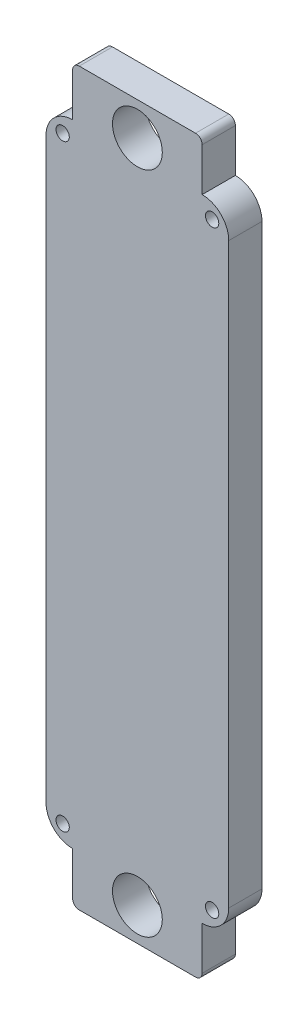
ISO-10303-21;
HEADER;
FILE_DESCRIPTION(('STEP AP214'),'2;1');
FILE_NAME('part.step','',(''),(''),'','','');
FILE_SCHEMA(('AUTOMOTIVE_DESIGN { 1 0 10303 214 1 1 1 1 }'));
ENDSEC;
DATA;
#1=APPLICATION_CONTEXT('core data for automotive mechanical design processes');
#2=APPLICATION_PROTOCOL_DEFINITION('international standard','automotive_design',2000,#1);
#3=PRODUCT_CONTEXT('',#1,'mechanical');
#4=PRODUCT('Part','Part','',(#3));
#5=PRODUCT_RELATED_PRODUCT_CATEGORY('part','',(#4));
#6=PRODUCT_DEFINITION_FORMATION('','',#4);
#7=PRODUCT_DEFINITION_CONTEXT('part definition',#1,'design');
#8=PRODUCT_DEFINITION('design','',#6,#7);
#9=PRODUCT_DEFINITION_SHAPE('','',#8);
#10=(LENGTH_UNIT() NAMED_UNIT(*) SI_UNIT(.MILLI.,.METRE.));
#11=(NAMED_UNIT(*) PLANE_ANGLE_UNIT() SI_UNIT($,.RADIAN.));
#12=(NAMED_UNIT(*) SI_UNIT($,.STERADIAN.) SOLID_ANGLE_UNIT());
#13=UNCERTAINTY_MEASURE_WITH_UNIT(LENGTH_MEASURE(1.E-05),#10,'distance_accuracy_value','');
#14=(GEOMETRIC_REPRESENTATION_CONTEXT(3) GLOBAL_UNCERTAINTY_ASSIGNED_CONTEXT((#13)) GLOBAL_UNIT_ASSIGNED_CONTEXT((#10,
#11,#12)) REPRESENTATION_CONTEXT('',''));
#15=CARTESIAN_POINT('',(0.,0.,0.));
#16=DIRECTION('',(0.,0.,1.));
#17=DIRECTION('',(1.,0.,0.));
#18=AXIS2_PLACEMENT_3D('',#15,#16,#17);
#19=CARTESIAN_POINT('',(0.,0.,10.));
#20=DIRECTION('',(0.,0.,1.));
#21=DIRECTION('',(1.,0.,0.));
#22=AXIS2_PLACEMENT_3D('',#19,#20,#21);
#23=PLANE('',#22);
#24=CARTESIAN_POINT('',(0.,100.,10.));
#25=DIRECTION('',(0.,0.,1.));
#26=DIRECTION('',(1.,0.,0.));
#27=AXIS2_PLACEMENT_3D('',#24,#25,#26);
#28=CIRCLE('',#27,7.5);
#29=CARTESIAN_POINT('',(7.5,100.,10.));
#30=VERTEX_POINT('',#29);
#31=EDGE_CURVE('E315',#30,#30,#28,.T.);
#32=ORIENTED_EDGE('',*,*,#31,.F.);
#33=EDGE_LOOP('',(#32));
#34=FACE_BOUND('',#33,.T.);
#35=CARTESIAN_POINT('',(0.,-100.,10.));
#36=DIRECTION('',(0.,0.,1.));
#37=DIRECTION('',(1.,0.,0.));
#38=AXIS2_PLACEMENT_3D('',#35,#36,#37);
#39=CIRCLE('',#38,7.5);
#40=CARTESIAN_POINT('',(7.5,-100.,10.));
#41=VERTEX_POINT('',#40);
#42=EDGE_CURVE('E391',#41,#41,#39,.T.);
#43=ORIENTED_EDGE('',*,*,#42,.F.);
#44=EDGE_LOOP('',(#43));
#45=FACE_BOUND('',#44,.T.);
#46=CARTESIAN_POINT('',(-22.5,-90.,10.));
#47=DIRECTION('',(0.,0.,1.));
#48=DIRECTION('',(1.,0.,0.));
#49=AXIS2_PLACEMENT_3D('',#46,#47,#48);
#50=CIRCLE('',#49,2.00000000000001);
#51=CARTESIAN_POINT('',(-20.5,-90.,10.));
#52=VERTEX_POINT('',#51);
#53=EDGE_CURVE('E348',#52,#52,#50,.T.);
#54=ORIENTED_EDGE('',*,*,#53,.F.);
#55=EDGE_LOOP('',(#54));
#56=FACE_BOUND('',#55,.T.);
#57=CARTESIAN_POINT('',(-22.5,90.,10.));
#58=DIRECTION('',(0.,0.,1.));
#59=DIRECTION('',(1.,0.,0.));
#60=AXIS2_PLACEMENT_3D('',#57,#58,#59);
#61=CIRCLE('',#60,2.00000000000001);
#62=CARTESIAN_POINT('',(-20.5,90.,10.));
#63=VERTEX_POINT('',#62);
#64=EDGE_CURVE('E364',#63,#63,#61,.T.);
#65=ORIENTED_EDGE('',*,*,#64,.F.);
#66=EDGE_LOOP('',(#65));
#67=FACE_BOUND('',#66,.T.);
#68=DIRECTION('',(-1.,0.,0.));
#69=VECTOR('',#68,1.);
#70=CARTESIAN_POINT('',(-19.5,110.,10.));
#71=LINE('',#70,#69);
#72=CARTESIAN_POINT('',(17.5,110.,10.));
#73=VERTEX_POINT('',#72);
#74=CARTESIAN_POINT('',(-17.5,110.,10.));
#75=VERTEX_POINT('',#74);
#76=EDGE_CURVE('E323',#73,#75,#71,.T.);
#77=ORIENTED_EDGE('',*,*,#76,.T.);
#78=CARTESIAN_POINT('',(-17.5,108.,10.));
#79=DIRECTION('',(0.,0.,1.));
#80=DIRECTION('',(1.,0.,0.));
#81=AXIS2_PLACEMENT_3D('',#78,#79,#80);
#82=CIRCLE('',#81,2.);
#83=CARTESIAN_POINT('',(-19.5,108.,10.));
#84=VERTEX_POINT('',#83);
#85=EDGE_CURVE('E257',#75,#84,#82,.T.);
#86=ORIENTED_EDGE('',*,*,#85,.T.);
#87=DIRECTION('',(0.,-1.,0.));
#88=VECTOR('',#87,1.);
#89=CARTESIAN_POINT('',(-19.5,95.,10.));
#90=LINE('',#89,#88);
#91=CARTESIAN_POINT('',(-19.5,95.,10.));
#92=VERTEX_POINT('',#91);
#93=EDGE_CURVE('E331',#84,#92,#90,.T.);
#94=ORIENTED_EDGE('',*,*,#93,.T.);
#95=CARTESIAN_POINT('',(-19.5,87.,10.));
#96=DIRECTION('',(0.,0.,1.));
#97=DIRECTION('',(1.,0.,0.));
#98=AXIS2_PLACEMENT_3D('',#95,#96,#97);
#99=CIRCLE('',#98,8.);
#100=CARTESIAN_POINT('',(-27.5,87.,10.));
#101=VERTEX_POINT('',#100);
#102=EDGE_CURVE('E222',#92,#101,#99,.T.);
#103=ORIENTED_EDGE('',*,*,#102,.T.);
#104=DIRECTION('',(0.,-1.,0.));
#105=VECTOR('',#104,1.);
#106=CARTESIAN_POINT('',(-27.5,95.,10.));
#107=LINE('',#106,#105);
#108=CARTESIAN_POINT('',(-27.5,-87.,10.));
#109=VERTEX_POINT('',#108);
#110=EDGE_CURVE('E189',#101,#109,#107,.T.);
#111=ORIENTED_EDGE('',*,*,#110,.T.);
#112=CARTESIAN_POINT('',(-19.5,-87.,10.));
#113=DIRECTION('',(0.,0.,1.));
#114=DIRECTION('',(1.,0.,0.));
#115=AXIS2_PLACEMENT_3D('',#112,#113,#114);
#116=CIRCLE('',#115,8.);
#117=CARTESIAN_POINT('',(-19.5,-95.,10.));
#118=VERTEX_POINT('',#117);
#119=EDGE_CURVE('E180',#109,#118,#116,.T.);
#120=ORIENTED_EDGE('',*,*,#119,.T.);
#121=DIRECTION('',(0.,-1.,0.));
#122=VECTOR('',#121,1.);
#123=CARTESIAN_POINT('',(-19.5,-95.,10.));
#124=LINE('',#123,#122);
#125=CARTESIAN_POINT('',(-19.5,-108.,10.));
#126=VERTEX_POINT('',#125);
#127=EDGE_CURVE('E305',#118,#126,#124,.T.);
#128=ORIENTED_EDGE('',*,*,#127,.T.);
#129=CARTESIAN_POINT('',(-17.5,-108.,10.));
#130=DIRECTION('',(0.,0.,1.));
#131=DIRECTION('',(1.,0.,0.));
#132=AXIS2_PLACEMENT_3D('',#129,#130,#131);
#133=CIRCLE('',#132,2.);
#134=CARTESIAN_POINT('',(-17.5,-110.,10.));
#135=VERTEX_POINT('',#134);
#136=EDGE_CURVE('E251',#126,#135,#133,.T.);
#137=ORIENTED_EDGE('',*,*,#136,.T.);
#138=DIRECTION('',(1.,0.,0.));
#139=VECTOR('',#138,1.);
#140=CARTESIAN_POINT('',(-19.5,-110.,10.));
#141=LINE('',#140,#139);
#142=CARTESIAN_POINT('',(17.5,-110.,10.));
#143=VERTEX_POINT('',#142);
#144=EDGE_CURVE('E170',#135,#143,#141,.T.);
#145=ORIENTED_EDGE('',*,*,#144,.T.);
#146=CARTESIAN_POINT('',(17.5,-108.,10.));
#147=DIRECTION('',(0.,0.,1.));
#148=DIRECTION('',(1.,0.,0.));
#149=AXIS2_PLACEMENT_3D('',#146,#147,#148);
#150=CIRCLE('',#149,2.);
#151=CARTESIAN_POINT('',(19.5,-108.,10.));
#152=VERTEX_POINT('',#151);
#153=EDGE_CURVE('E164',#143,#152,#150,.T.);
#154=ORIENTED_EDGE('',*,*,#153,.T.);
#155=DIRECTION('',(0.,1.,0.));
#156=VECTOR('',#155,1.);
#157=CARTESIAN_POINT('',(19.5,-95.,10.));
#158=LINE('',#157,#156);
#159=CARTESIAN_POINT('',(19.5,-95.,10.));
#160=VERTEX_POINT('',#159);
#161=EDGE_CURVE('E156',#152,#160,#158,.T.);
#162=ORIENTED_EDGE('',*,*,#161,.T.);
#163=CARTESIAN_POINT('',(19.5,-87.,10.));
#164=DIRECTION('',(0.,0.,1.));
#165=DIRECTION('',(1.,0.,0.));
#166=AXIS2_PLACEMENT_3D('',#163,#164,#165);
#167=CIRCLE('',#166,8.);
#168=CARTESIAN_POINT('',(27.5,-87.,10.));
#169=VERTEX_POINT('',#168);
#170=EDGE_CURVE('E161',#160,#169,#167,.T.);
#171=ORIENTED_EDGE('',*,*,#170,.T.);
#172=DIRECTION('',(0.,1.,0.));
#173=VECTOR('',#172,1.);
#174=CARTESIAN_POINT('',(27.5,95.,10.));
#175=LINE('',#174,#173);
#176=CARTESIAN_POINT('',(27.5,87.,10.));
#177=VERTEX_POINT('',#176);
#178=EDGE_CURVE('E197',#169,#177,#175,.T.);
#179=ORIENTED_EDGE('',*,*,#178,.T.);
#180=CARTESIAN_POINT('',(19.5,87.,10.));
#181=DIRECTION('',(0.,0.,1.));
#182=DIRECTION('',(1.,0.,0.));
#183=AXIS2_PLACEMENT_3D('',#180,#181,#182);
#184=CIRCLE('',#183,8.);
#185=CARTESIAN_POINT('',(19.5,95.,10.));
#186=VERTEX_POINT('',#185);
#187=EDGE_CURVE('E181',#177,#186,#184,.T.);
#188=ORIENTED_EDGE('',*,*,#187,.T.);
#189=DIRECTION('',(0.,1.,0.));
#190=VECTOR('',#189,1.);
#191=CARTESIAN_POINT('',(19.5,95.,10.));
#192=LINE('',#191,#190);
#193=CARTESIAN_POINT('',(19.5,108.,10.));
#194=VERTEX_POINT('',#193);
#195=EDGE_CURVE('E334',#186,#194,#192,.T.);
#196=ORIENTED_EDGE('',*,*,#195,.T.);
#197=CARTESIAN_POINT('',(17.5,108.,10.));
#198=DIRECTION('',(0.,0.,1.));
#199=DIRECTION('',(1.,0.,0.));
#200=AXIS2_PLACEMENT_3D('',#197,#198,#199);
#201=CIRCLE('',#200,2.);
#202=EDGE_CURVE('E254',#194,#73,#201,.T.);
#203=ORIENTED_EDGE('',*,*,#202,.T.);
#204=EDGE_LOOP('',(#77,#86,#94,#103,#111,#120,#128,#137,#145,#154,#162,#171,#179,#188,#196,#203));
#205=FACE_BOUND('',#204,.T.);
#206=CARTESIAN_POINT('',(22.5,90.,10.));
#207=DIRECTION('',(0.,0.,1.));
#208=DIRECTION('',(1.,0.,0.));
#209=AXIS2_PLACEMENT_3D('',#206,#207,#208);
#210=CIRCLE('',#209,2.00000000000001);
#211=CARTESIAN_POINT('',(24.5,90.,10.));
#212=VERTEX_POINT('',#211);
#213=EDGE_CURVE('E356',#212,#212,#210,.T.);
#214=ORIENTED_EDGE('',*,*,#213,.F.);
#215=EDGE_LOOP('',(#214));
#216=FACE_BOUND('',#215,.T.);
#217=CARTESIAN_POINT('',(22.5,-90.,10.));
#218=DIRECTION('',(0.,0.,1.));
#219=DIRECTION('',(1.,0.,0.));
#220=AXIS2_PLACEMENT_3D('',#217,#218,#219);
#221=CIRCLE('',#220,2.);
#222=CARTESIAN_POINT('',(24.5,-90.,10.));
#223=VERTEX_POINT('',#222);
#224=EDGE_CURVE('E340',#223,#223,#221,.T.);
#225=ORIENTED_EDGE('',*,*,#224,.F.);
#226=EDGE_LOOP('',(#225));
#227=FACE_BOUND('',#226,.T.);
#228=ADVANCED_FACE('F41',(#34,#45,#56,#67,#205,#216,#227),#23,.T.);
#229=CARTESIAN_POINT('',(0.,0.,0.));
#230=DIRECTION('',(0.,0.,1.));
#231=DIRECTION('',(1.,0.,0.));
#232=AXIS2_PLACEMENT_3D('',#229,#230,#231);
#233=PLANE('',#232);
#234=CARTESIAN_POINT('',(0.,100.,0.));
#235=DIRECTION('',(0.,0.,1.));
#236=DIRECTION('',(1.,0.,0.));
#237=AXIS2_PLACEMENT_3D('',#234,#235,#236);
#238=CIRCLE('',#237,7.5);
#239=CARTESIAN_POINT('',(7.5,100.,0.));
#240=VERTEX_POINT('',#239);
#241=EDGE_CURVE('E309',#240,#240,#238,.T.);
#242=ORIENTED_EDGE('',*,*,#241,.T.);
#243=EDGE_LOOP('',(#242));
#244=FACE_BOUND('',#243,.T.);
#245=CARTESIAN_POINT('',(0.,-100.,0.));
#246=DIRECTION('',(0.,0.,1.));
#247=DIRECTION('',(1.,0.,0.));
#248=AXIS2_PLACEMENT_3D('',#245,#246,#247);
#249=CIRCLE('',#248,7.5);
#250=CARTESIAN_POINT('',(7.5,-100.,0.));
#251=VERTEX_POINT('',#250);
#252=EDGE_CURVE('E395',#251,#251,#249,.T.);
#253=ORIENTED_EDGE('',*,*,#252,.T.);
#254=EDGE_LOOP('',(#253));
#255=FACE_BOUND('',#254,.T.);
#256=DIRECTION('',(0.,-1.,0.));
#257=VECTOR('',#256,1.);
#258=CARTESIAN_POINT('',(-19.5,95.,0.));
#259=LINE('',#258,#257);
#260=CARTESIAN_POINT('',(-19.5,108.,0.));
#261=VERTEX_POINT('',#260);
#262=CARTESIAN_POINT('',(-19.5,95.,0.));
#263=VERTEX_POINT('',#262);
#264=EDGE_CURVE('E319',#261,#263,#259,.T.);
#265=ORIENTED_EDGE('',*,*,#264,.F.);
#266=CARTESIAN_POINT('',(-17.5,108.,0.));
#267=DIRECTION('',(0.,0.,1.));
#268=DIRECTION('',(1.,0.,0.));
#269=AXIS2_PLACEMENT_3D('',#266,#267,#268);
#270=CIRCLE('',#269,2.);
#271=CARTESIAN_POINT('',(-17.5,110.,0.));
#272=VERTEX_POINT('',#271);
#273=EDGE_CURVE('E270',#261,#272,#270,.F.);
#274=ORIENTED_EDGE('',*,*,#273,.T.);
#275=DIRECTION('',(-1.,0.,0.));
#276=VECTOR('',#275,1.);
#277=CARTESIAN_POINT('',(-19.5,110.,0.));
#278=LINE('',#277,#276);
#279=CARTESIAN_POINT('',(17.5,110.,0.));
#280=VERTEX_POINT('',#279);
#281=EDGE_CURVE('E326',#280,#272,#278,.T.);
#282=ORIENTED_EDGE('',*,*,#281,.F.);
#283=CARTESIAN_POINT('',(17.5,108.,0.));
#284=DIRECTION('',(0.,0.,1.));
#285=DIRECTION('',(1.,0.,0.));
#286=AXIS2_PLACEMENT_3D('',#283,#284,#285);
#287=CIRCLE('',#286,2.);
#288=CARTESIAN_POINT('',(19.5,108.,0.));
#289=VERTEX_POINT('',#288);
#290=EDGE_CURVE('E57',#280,#289,#287,.F.);
#291=ORIENTED_EDGE('',*,*,#290,.T.);
#292=DIRECTION('',(0.,1.,0.));
#293=VECTOR('',#292,1.);
#294=CARTESIAN_POINT('',(19.5,95.,0.));
#295=LINE('',#294,#293);
#296=CARTESIAN_POINT('',(19.5,95.,0.));
#297=VERTEX_POINT('',#296);
#298=EDGE_CURVE('E322',#297,#289,#295,.T.);
#299=ORIENTED_EDGE('',*,*,#298,.F.);
#300=CARTESIAN_POINT('',(19.5,87.,0.));
#301=DIRECTION('',(0.,0.,1.));
#302=DIRECTION('',(1.,0.,0.));
#303=AXIS2_PLACEMENT_3D('',#300,#301,#302);
#304=CIRCLE('',#303,8.);
#305=CARTESIAN_POINT('',(27.5,87.,0.));
#306=VERTEX_POINT('',#305);
#307=EDGE_CURVE('E206',#297,#306,#304,.F.);
#308=ORIENTED_EDGE('',*,*,#307,.T.);
#309=DIRECTION('',(0.,1.,0.));
#310=VECTOR('',#309,1.);
#311=CARTESIAN_POINT('',(27.5,95.,0.));
#312=LINE('',#311,#310);
#313=CARTESIAN_POINT('',(27.5,-87.,0.));
#314=VERTEX_POINT('',#313);
#315=EDGE_CURVE('E368',#314,#306,#312,.T.);
#316=ORIENTED_EDGE('',*,*,#315,.F.);
#317=CARTESIAN_POINT('',(19.5,-87.,0.));
#318=DIRECTION('',(0.,0.,1.));
#319=DIRECTION('',(1.,0.,0.));
#320=AXIS2_PLACEMENT_3D('',#317,#318,#319);
#321=CIRCLE('',#320,8.);
#322=CARTESIAN_POINT('',(19.5,-95.,0.));
#323=VERTEX_POINT('',#322);
#324=EDGE_CURVE('E209',#314,#323,#321,.F.);
#325=ORIENTED_EDGE('',*,*,#324,.T.);
#326=DIRECTION('',(0.,1.,0.));
#327=VECTOR('',#326,1.);
#328=CARTESIAN_POINT('',(19.5,-95.,0.));
#329=LINE('',#328,#327);
#330=CARTESIAN_POINT('',(19.5,-108.,0.));
#331=VERTEX_POINT('',#330);
#332=EDGE_CURVE('E185',#331,#323,#329,.T.);
#333=ORIENTED_EDGE('',*,*,#332,.F.);
#334=CARTESIAN_POINT('',(17.5,-108.,0.));
#335=DIRECTION('',(0.,0.,1.));
#336=DIRECTION('',(1.,0.,0.));
#337=AXIS2_PLACEMENT_3D('',#334,#335,#336);
#338=CIRCLE('',#337,2.);
#339=CARTESIAN_POINT('',(17.5,-110.,0.));
#340=VERTEX_POINT('',#339);
#341=EDGE_CURVE('E263',#331,#340,#338,.F.);
#342=ORIENTED_EDGE('',*,*,#341,.T.);
#343=DIRECTION('',(1.,0.,0.));
#344=VECTOR('',#343,1.);
#345=CARTESIAN_POINT('',(-19.5,-110.,0.));
#346=LINE('',#345,#344);
#347=CARTESIAN_POINT('',(-17.5,-110.,0.));
#348=VERTEX_POINT('',#347);
#349=EDGE_CURVE('E290',#348,#340,#346,.T.);
#350=ORIENTED_EDGE('',*,*,#349,.F.);
#351=CARTESIAN_POINT('',(-17.5,-108.,0.));
#352=DIRECTION('',(0.,0.,1.));
#353=DIRECTION('',(1.,0.,0.));
#354=AXIS2_PLACEMENT_3D('',#351,#352,#353);
#355=CIRCLE('',#354,2.);
#356=CARTESIAN_POINT('',(-19.5,-108.,0.));
#357=VERTEX_POINT('',#356);
#358=EDGE_CURVE('E64',#348,#357,#355,.F.);
#359=ORIENTED_EDGE('',*,*,#358,.T.);
#360=DIRECTION('',(0.,-1.,0.));
#361=VECTOR('',#360,1.);
#362=CARTESIAN_POINT('',(-19.5,-95.,0.));
#363=LINE('',#362,#361);
#364=CARTESIAN_POINT('',(-19.5,-95.,0.));
#365=VERTEX_POINT('',#364);
#366=EDGE_CURVE('E169',#365,#357,#363,.T.);
#367=ORIENTED_EDGE('',*,*,#366,.F.);
#368=CARTESIAN_POINT('',(-19.5,-87.,0.));
#369=DIRECTION('',(0.,0.,1.));
#370=DIRECTION('',(1.,0.,0.));
#371=AXIS2_PLACEMENT_3D('',#368,#369,#370);
#372=CIRCLE('',#371,8.);
#373=CARTESIAN_POINT('',(-27.5,-87.,0.));
#374=VERTEX_POINT('',#373);
#375=EDGE_CURVE('E212',#365,#374,#372,.F.);
#376=ORIENTED_EDGE('',*,*,#375,.T.);
#377=DIRECTION('',(0.,-1.,0.));
#378=VECTOR('',#377,1.);
#379=CARTESIAN_POINT('',(-27.5,95.,0.));
#380=LINE('',#379,#378);
#381=CARTESIAN_POINT('',(-27.5,87.,0.));
#382=VERTEX_POINT('',#381);
#383=EDGE_CURVE('E200',#382,#374,#380,.T.);
#384=ORIENTED_EDGE('',*,*,#383,.F.);
#385=CARTESIAN_POINT('',(-19.5,87.,0.));
#386=DIRECTION('',(0.,0.,1.));
#387=DIRECTION('',(1.,0.,0.));
#388=AXIS2_PLACEMENT_3D('',#385,#386,#387);
#389=CIRCLE('',#388,8.);
#390=EDGE_CURVE('E194',#382,#263,#389,.F.);
#391=ORIENTED_EDGE('',*,*,#390,.T.);
#392=EDGE_LOOP('',(#265,#274,#282,#291,#299,#308,#316,#325,#333,#342,#350,#359,#367,#376,#384,#391));
#393=FACE_BOUND('',#392,.T.);
#394=CARTESIAN_POINT('',(-22.5,90.,0.));
#395=DIRECTION('',(0.,0.,1.));
#396=DIRECTION('',(1.,0.,0.));
#397=AXIS2_PLACEMENT_3D('',#394,#395,#396);
#398=CIRCLE('',#397,2.00000000000001);
#399=CARTESIAN_POINT('',(-20.5,90.,0.));
#400=VERTEX_POINT('',#399);
#401=EDGE_CURVE('E360',#400,#400,#398,.T.);
#402=ORIENTED_EDGE('',*,*,#401,.T.);
#403=EDGE_LOOP('',(#402));
#404=FACE_BOUND('',#403,.T.);
#405=CARTESIAN_POINT('',(22.5,90.,0.));
#406=DIRECTION('',(0.,0.,1.));
#407=DIRECTION('',(1.,0.,0.));
#408=AXIS2_PLACEMENT_3D('',#405,#406,#407);
#409=CIRCLE('',#408,2.00000000000001);
#410=CARTESIAN_POINT('',(24.5,90.,0.));
#411=VERTEX_POINT('',#410);
#412=EDGE_CURVE('E352',#411,#411,#409,.T.);
#413=ORIENTED_EDGE('',*,*,#412,.T.);
#414=EDGE_LOOP('',(#413));
#415=FACE_BOUND('',#414,.T.);
#416=CARTESIAN_POINT('',(-22.5,-90.,0.));
#417=DIRECTION('',(0.,0.,1.));
#418=DIRECTION('',(1.,0.,0.));
#419=AXIS2_PLACEMENT_3D('',#416,#417,#418);
#420=CIRCLE('',#419,2.00000000000001);
#421=CARTESIAN_POINT('',(-20.5,-90.,0.));
#422=VERTEX_POINT('',#421);
#423=EDGE_CURVE('E344',#422,#422,#420,.T.);
#424=ORIENTED_EDGE('',*,*,#423,.T.);
#425=EDGE_LOOP('',(#424));
#426=FACE_BOUND('',#425,.T.);
#427=CARTESIAN_POINT('',(22.5,-90.,0.));
#428=DIRECTION('',(0.,0.,1.));
#429=DIRECTION('',(1.,0.,0.));
#430=AXIS2_PLACEMENT_3D('',#427,#428,#429);
#431=CIRCLE('',#430,2.);
#432=CARTESIAN_POINT('',(24.5,-90.,0.));
#433=VERTEX_POINT('',#432);
#434=EDGE_CURVE('E330',#433,#433,#431,.T.);
#435=ORIENTED_EDGE('',*,*,#434,.T.);
#436=EDGE_LOOP('',(#435));
#437=FACE_BOUND('',#436,.T.);
#438=ADVANCED_FACE('F294',(#244,#255,#393,#404,#415,#426,#437),#233,.F.);
#439=CARTESIAN_POINT('',(27.5,95.,10.));
#440=DIRECTION('',(-1.,0.,0.));
#441=DIRECTION('',(0.,-1.,0.));
#442=AXIS2_PLACEMENT_3D('',#439,#440,#441);
#443=PLANE('',#442);
#444=ORIENTED_EDGE('',*,*,#178,.F.);
#445=DIRECTION('',(0.,0.,-1.));
#446=VECTOR('',#445,1.);
#447=CARTESIAN_POINT('',(27.5,-87.,10.));
#448=LINE('',#447,#446);
#449=EDGE_CURVE('E178',#169,#314,#448,.T.);
#450=ORIENTED_EDGE('',*,*,#449,.T.);
#451=ORIENTED_EDGE('',*,*,#315,.T.);
#452=DIRECTION('',(0.,0.,-1.));
#453=VECTOR('',#452,1.);
#454=CARTESIAN_POINT('',(27.5,87.,10.));
#455=LINE('',#454,#453);
#456=EDGE_CURVE('E229',#306,#177,#455,.F.);
#457=ORIENTED_EDGE('',*,*,#456,.T.);
#458=EDGE_LOOP('',(#444,#450,#451,#457));
#459=FACE_BOUND('',#458,.T.);
#460=ADVANCED_FACE('F422',(#459),#443,.F.);
#461=CARTESIAN_POINT('',(-27.5,95.,10.));
#462=DIRECTION('',(1.,0.,0.));
#463=DIRECTION('',(0.,1.,0.));
#464=AXIS2_PLACEMENT_3D('',#461,#462,#463);
#465=PLANE('',#464);
#466=ORIENTED_EDGE('',*,*,#383,.T.);
#467=DIRECTION('',(0.,0.,-1.));
#468=VECTOR('',#467,1.);
#469=CARTESIAN_POINT('',(-27.5,-87.,10.));
#470=LINE('',#469,#468);
#471=EDGE_CURVE('E219',#374,#109,#470,.F.);
#472=ORIENTED_EDGE('',*,*,#471,.T.);
#473=ORIENTED_EDGE('',*,*,#110,.F.);
#474=DIRECTION('',(0.,0.,-1.));
#475=VECTOR('',#474,1.);
#476=CARTESIAN_POINT('',(-27.5,87.,10.));
#477=LINE('',#476,#475);
#478=EDGE_CURVE('E215',#101,#382,#477,.T.);
#479=ORIENTED_EDGE('',*,*,#478,.T.);
#480=EDGE_LOOP('',(#466,#472,#473,#479));
#481=FACE_BOUND('',#480,.T.);
#482=ADVANCED_FACE('F383',(#481),#465,.F.);
#483=CARTESIAN_POINT('',(-22.5,90.,10.));
#484=DIRECTION('',(0.,0.,-1.));
#485=DIRECTION('',(-1.,0.,0.));
#486=AXIS2_PLACEMENT_3D('',#483,#484,#485);
#487=CYLINDRICAL_SURFACE('',#486,2.00000000000001);
#488=ORIENTED_EDGE('',*,*,#64,.T.);
#489=EDGE_LOOP('',(#488));
#490=FACE_BOUND('',#489,.T.);
#491=ORIENTED_EDGE('',*,*,#401,.F.);
#492=EDGE_LOOP('',(#491));
#493=FACE_BOUND('',#492,.T.);
#494=ADVANCED_FACE('F414',(#490,#493),#487,.F.);
#495=CARTESIAN_POINT('',(22.5,90.,10.));
#496=DIRECTION('',(0.,0.,-1.));
#497=DIRECTION('',(-1.,0.,0.));
#498=AXIS2_PLACEMENT_3D('',#495,#496,#497);
#499=CYLINDRICAL_SURFACE('',#498,2.00000000000001);
#500=ORIENTED_EDGE('',*,*,#213,.T.);
#501=EDGE_LOOP('',(#500));
#502=FACE_BOUND('',#501,.T.);
#503=ORIENTED_EDGE('',*,*,#412,.F.);
#504=EDGE_LOOP('',(#503));
#505=FACE_BOUND('',#504,.T.);
#506=ADVANCED_FACE('F417',(#502,#505),#499,.F.);
#507=CARTESIAN_POINT('',(-22.5,-90.,10.));
#508=DIRECTION('',(0.,0.,-1.));
#509=DIRECTION('',(-1.,0.,0.));
#510=AXIS2_PLACEMENT_3D('',#507,#508,#509);
#511=CYLINDRICAL_SURFACE('',#510,2.00000000000001);
#512=ORIENTED_EDGE('',*,*,#53,.T.);
#513=EDGE_LOOP('',(#512));
#514=FACE_BOUND('',#513,.T.);
#515=ORIENTED_EDGE('',*,*,#423,.F.);
#516=EDGE_LOOP('',(#515));
#517=FACE_BOUND('',#516,.T.);
#518=ADVANCED_FACE('F433',(#514,#517),#511,.F.);
#519=CARTESIAN_POINT('',(22.5,-90.,10.));
#520=DIRECTION('',(0.,0.,-1.));
#521=DIRECTION('',(-1.,0.,0.));
#522=AXIS2_PLACEMENT_3D('',#519,#520,#521);
#523=CYLINDRICAL_SURFACE('',#522,2.);
#524=ORIENTED_EDGE('',*,*,#224,.T.);
#525=EDGE_LOOP('',(#524));
#526=FACE_BOUND('',#525,.T.);
#527=ORIENTED_EDGE('',*,*,#434,.F.);
#528=EDGE_LOOP('',(#527));
#529=FACE_BOUND('',#528,.T.);
#530=ADVANCED_FACE('F431',(#526,#529),#523,.F.);
#531=CARTESIAN_POINT('',(-19.5,-87.,10.));
#532=DIRECTION('',(0.,0.,-1.));
#533=DIRECTION('',(-1.,0.,0.));
#534=AXIS2_PLACEMENT_3D('',#531,#532,#533);
#535=CYLINDRICAL_SURFACE('',#534,8.);
#536=ORIENTED_EDGE('',*,*,#119,.F.);
#537=ORIENTED_EDGE('',*,*,#471,.F.);
#538=ORIENTED_EDGE('',*,*,#375,.F.);
#539=DIRECTION('',(0.,0.,-1.));
#540=VECTOR('',#539,1.);
#541=CARTESIAN_POINT('',(-19.5,-95.,10.));
#542=LINE('',#541,#540);
#543=EDGE_CURVE('E188',#118,#365,#542,.T.);
#544=ORIENTED_EDGE('',*,*,#543,.F.);
#545=EDGE_LOOP('',(#536,#537,#538,#544));
#546=FACE_BOUND('',#545,.T.);
#547=ADVANCED_FACE('F387',(#546),#535,.T.);
#548=CARTESIAN_POINT('',(19.5,-87.,10.));
#549=DIRECTION('',(0.,0.,-1.));
#550=DIRECTION('',(-1.,0.,0.));
#551=AXIS2_PLACEMENT_3D('',#548,#549,#550);
#552=CYLINDRICAL_SURFACE('',#551,8.);
#553=ORIENTED_EDGE('',*,*,#170,.F.);
#554=DIRECTION('',(0.,0.,-1.));
#555=VECTOR('',#554,1.);
#556=CARTESIAN_POINT('',(19.5,-95.,10.));
#557=LINE('',#556,#555);
#558=EDGE_CURVE('E176',#323,#160,#557,.F.);
#559=ORIENTED_EDGE('',*,*,#558,.F.);
#560=ORIENTED_EDGE('',*,*,#324,.F.);
#561=ORIENTED_EDGE('',*,*,#449,.F.);
#562=EDGE_LOOP('',(#553,#559,#560,#561));
#563=FACE_BOUND('',#562,.T.);
#564=ADVANCED_FACE('F175',(#563),#552,.T.);
#565=CARTESIAN_POINT('',(19.5,87.,10.));
#566=DIRECTION('',(0.,0.,-1.));
#567=DIRECTION('',(-1.,0.,0.));
#568=AXIS2_PLACEMENT_3D('',#565,#566,#567);
#569=CYLINDRICAL_SURFACE('',#568,8.);
#570=ORIENTED_EDGE('',*,*,#187,.F.);
#571=ORIENTED_EDGE('',*,*,#456,.F.);
#572=ORIENTED_EDGE('',*,*,#307,.F.);
#573=DIRECTION('',(0.,0.,-1.));
#574=VECTOR('',#573,1.);
#575=CARTESIAN_POINT('',(19.5,95.,10.));
#576=LINE('',#575,#574);
#577=EDGE_CURVE('E238',#186,#297,#576,.T.);
#578=ORIENTED_EDGE('',*,*,#577,.F.);
#579=EDGE_LOOP('',(#570,#571,#572,#578));
#580=FACE_BOUND('',#579,.T.);
#581=ADVANCED_FACE('F456',(#580),#569,.T.);
#582=CARTESIAN_POINT('',(-19.5,87.,10.));
#583=DIRECTION('',(0.,0.,-1.));
#584=DIRECTION('',(-1.,0.,0.));
#585=AXIS2_PLACEMENT_3D('',#582,#583,#584);
#586=CYLINDRICAL_SURFACE('',#585,8.);
#587=ORIENTED_EDGE('',*,*,#102,.F.);
#588=DIRECTION('',(0.,0.,-1.));
#589=VECTOR('',#588,1.);
#590=CARTESIAN_POINT('',(-19.5,95.,10.));
#591=LINE('',#590,#589);
#592=EDGE_CURVE('E234',#263,#92,#591,.F.);
#593=ORIENTED_EDGE('',*,*,#592,.F.);
#594=ORIENTED_EDGE('',*,*,#390,.F.);
#595=ORIENTED_EDGE('',*,*,#478,.F.);
#596=EDGE_LOOP('',(#587,#593,#594,#595));
#597=FACE_BOUND('',#596,.T.);
#598=ADVANCED_FACE('F459',(#597),#586,.T.);
#599=CARTESIAN_POINT('',(-19.5,95.,0.));
#600=DIRECTION('',(-1.,0.,0.));
#601=DIRECTION('',(0.,-1.,0.));
#602=AXIS2_PLACEMENT_3D('',#599,#600,#601);
#603=PLANE('',#602);
#604=ORIENTED_EDGE('',*,*,#93,.F.);
#605=DIRECTION('',(0.,0.,1.));
#606=VECTOR('',#605,1.);
#607=CARTESIAN_POINT('',(-19.5,108.,0.));
#608=LINE('',#607,#606);
#609=EDGE_CURVE('E260',#84,#261,#608,.F.);
#610=ORIENTED_EDGE('',*,*,#609,.T.);
#611=ORIENTED_EDGE('',*,*,#264,.T.);
#612=ORIENTED_EDGE('',*,*,#592,.T.);
#613=EDGE_LOOP('',(#604,#610,#611,#612));
#614=FACE_BOUND('',#613,.T.);
#615=ADVANCED_FACE('F444',(#614),#603,.T.);
#616=CARTESIAN_POINT('',(-19.5,110.,0.));
#617=DIRECTION('',(0.,1.,0.));
#618=DIRECTION('',(0.,0.,1.));
#619=AXIS2_PLACEMENT_3D('',#616,#617,#618);
#620=PLANE('',#619);
#621=ORIENTED_EDGE('',*,*,#281,.T.);
#622=DIRECTION('',(0.,0.,1.));
#623=VECTOR('',#622,1.);
#624=CARTESIAN_POINT('',(-17.5,110.,0.));
#625=LINE('',#624,#623);
#626=EDGE_CURVE('E245',#272,#75,#625,.T.);
#627=ORIENTED_EDGE('',*,*,#626,.T.);
#628=ORIENTED_EDGE('',*,*,#76,.F.);
#629=DIRECTION('',(0.,0.,1.));
#630=VECTOR('',#629,1.);
#631=CARTESIAN_POINT('',(17.5,110.,0.));
#632=LINE('',#631,#630);
#633=EDGE_CURVE('E242',#73,#280,#632,.F.);
#634=ORIENTED_EDGE('',*,*,#633,.T.);
#635=EDGE_LOOP('',(#621,#627,#628,#634));
#636=FACE_BOUND('',#635,.T.);
#637=ADVANCED_FACE('F488',(#636),#620,.T.);
#638=CARTESIAN_POINT('',(19.5,95.,0.));
#639=DIRECTION('',(1.,0.,0.));
#640=DIRECTION('',(0.,0.,-1.));
#641=AXIS2_PLACEMENT_3D('',#638,#639,#640);
#642=PLANE('',#641);
#643=ORIENTED_EDGE('',*,*,#298,.T.);
#644=DIRECTION('',(0.,0.,1.));
#645=VECTOR('',#644,1.);
#646=CARTESIAN_POINT('',(19.5,108.,0.));
#647=LINE('',#646,#645);
#648=EDGE_CURVE('E273',#289,#194,#647,.T.);
#649=ORIENTED_EDGE('',*,*,#648,.T.);
#650=ORIENTED_EDGE('',*,*,#195,.F.);
#651=ORIENTED_EDGE('',*,*,#577,.T.);
#652=EDGE_LOOP('',(#643,#649,#650,#651));
#653=FACE_BOUND('',#652,.T.);
#654=ADVANCED_FACE('F483',(#653),#642,.T.);
#655=CARTESIAN_POINT('',(-19.5,-95.,0.));
#656=DIRECTION('',(-1.,0.,0.));
#657=DIRECTION('',(0.,-1.,0.));
#658=AXIS2_PLACEMENT_3D('',#655,#656,#657);
#659=PLANE('',#658);
#660=ORIENTED_EDGE('',*,*,#366,.T.);
#661=DIRECTION('',(0.,0.,1.));
#662=VECTOR('',#661,1.);
#663=CARTESIAN_POINT('',(-19.5,-108.,0.));
#664=LINE('',#663,#662);
#665=EDGE_CURVE('E277',#357,#126,#664,.T.);
#666=ORIENTED_EDGE('',*,*,#665,.T.);
#667=ORIENTED_EDGE('',*,*,#127,.F.);
#668=ORIENTED_EDGE('',*,*,#543,.T.);
#669=EDGE_LOOP('',(#660,#666,#667,#668));
#670=FACE_BOUND('',#669,.T.);
#671=ADVANCED_FACE('F304',(#670),#659,.T.);
#672=CARTESIAN_POINT('',(19.5,-95.,0.));
#673=DIRECTION('',(1.,0.,0.));
#674=DIRECTION('',(0.,0.,-1.));
#675=AXIS2_PLACEMENT_3D('',#672,#673,#674);
#676=PLANE('',#675);
#677=ORIENTED_EDGE('',*,*,#161,.F.);
#678=DIRECTION('',(0.,0.,1.));
#679=VECTOR('',#678,1.);
#680=CARTESIAN_POINT('',(19.5,-108.,0.));
#681=LINE('',#680,#679);
#682=EDGE_CURVE('E11',#152,#331,#681,.F.);
#683=ORIENTED_EDGE('',*,*,#682,.T.);
#684=ORIENTED_EDGE('',*,*,#332,.T.);
#685=ORIENTED_EDGE('',*,*,#558,.T.);
#686=EDGE_LOOP('',(#677,#683,#684,#685));
#687=FACE_BOUND('',#686,.T.);
#688=ADVANCED_FACE('F183',(#687),#676,.T.);
#689=CARTESIAN_POINT('',(-19.5,-110.,0.));
#690=DIRECTION('',(0.,-1.,0.));
#691=DIRECTION('',(0.,0.,-1.));
#692=AXIS2_PLACEMENT_3D('',#689,#690,#691);
#693=PLANE('',#692);
#694=ORIENTED_EDGE('',*,*,#144,.F.);
#695=DIRECTION('',(0.,0.,1.));
#696=VECTOR('',#695,1.);
#697=CARTESIAN_POINT('',(-17.5,-110.,0.));
#698=LINE('',#697,#696);
#699=EDGE_CURVE('E50',#135,#348,#698,.F.);
#700=ORIENTED_EDGE('',*,*,#699,.T.);
#701=ORIENTED_EDGE('',*,*,#349,.T.);
#702=DIRECTION('',(0.,0.,1.));
#703=VECTOR('',#702,1.);
#704=CARTESIAN_POINT('',(17.5,-110.,0.));
#705=LINE('',#704,#703);
#706=EDGE_CURVE('E281',#340,#143,#705,.T.);
#707=ORIENTED_EDGE('',*,*,#706,.T.);
#708=EDGE_LOOP('',(#694,#700,#701,#707));
#709=FACE_BOUND('',#708,.T.);
#710=ADVANCED_FACE('F289',(#709),#693,.T.);
#711=CARTESIAN_POINT('',(0.,-100.,0.));
#712=DIRECTION('',(0.,0.,1.));
#713=DIRECTION('',(1.,0.,0.));
#714=AXIS2_PLACEMENT_3D('',#711,#712,#713);
#715=CYLINDRICAL_SURFACE('',#714,7.5);
#716=ORIENTED_EDGE('',*,*,#252,.F.);
#717=EDGE_LOOP('',(#716));
#718=FACE_BOUND('',#717,.T.);
#719=ORIENTED_EDGE('',*,*,#42,.T.);
#720=EDGE_LOOP('',(#719));
#721=FACE_BOUND('',#720,.T.);
#722=ADVANCED_FACE('F509',(#718,#721),#715,.F.);
#723=CARTESIAN_POINT('',(0.,100.,0.));
#724=DIRECTION('',(0.,0.,1.));
#725=DIRECTION('',(1.,0.,0.));
#726=AXIS2_PLACEMENT_3D('',#723,#724,#725);
#727=CYLINDRICAL_SURFACE('',#726,7.5);
#728=ORIENTED_EDGE('',*,*,#241,.F.);
#729=EDGE_LOOP('',(#728));
#730=FACE_BOUND('',#729,.T.);
#731=ORIENTED_EDGE('',*,*,#31,.T.);
#732=EDGE_LOOP('',(#731));
#733=FACE_BOUND('',#732,.T.);
#734=ADVANCED_FACE('F403',(#730,#733),#727,.F.);
#735=CARTESIAN_POINT('',(-17.5,108.,0.));
#736=DIRECTION('',(0.,0.,1.));
#737=DIRECTION('',(1.,0.,0.));
#738=AXIS2_PLACEMENT_3D('',#735,#736,#737);
#739=CYLINDRICAL_SURFACE('',#738,2.);
#740=ORIENTED_EDGE('',*,*,#273,.F.);
#741=ORIENTED_EDGE('',*,*,#609,.F.);
#742=ORIENTED_EDGE('',*,*,#85,.F.);
#743=ORIENTED_EDGE('',*,*,#626,.F.);
#744=EDGE_LOOP('',(#740,#741,#742,#743));
#745=FACE_BOUND('',#744,.T.);
#746=ADVANCED_FACE('F464',(#745),#739,.T.);
#747=CARTESIAN_POINT('',(17.5,108.,0.));
#748=DIRECTION('',(0.,0.,1.));
#749=DIRECTION('',(1.,0.,0.));
#750=AXIS2_PLACEMENT_3D('',#747,#748,#749);
#751=CYLINDRICAL_SURFACE('',#750,2.);
#752=ORIENTED_EDGE('',*,*,#290,.F.);
#753=ORIENTED_EDGE('',*,*,#633,.F.);
#754=ORIENTED_EDGE('',*,*,#202,.F.);
#755=ORIENTED_EDGE('',*,*,#648,.F.);
#756=EDGE_LOOP('',(#752,#753,#754,#755));
#757=FACE_BOUND('',#756,.T.);
#758=ADVANCED_FACE('F467',(#757),#751,.T.);
#759=CARTESIAN_POINT('',(-17.5,-108.,0.));
#760=DIRECTION('',(0.,0.,1.));
#761=DIRECTION('',(1.,0.,0.));
#762=AXIS2_PLACEMENT_3D('',#759,#760,#761);
#763=CYLINDRICAL_SURFACE('',#762,2.);
#764=ORIENTED_EDGE('',*,*,#358,.F.);
#765=ORIENTED_EDGE('',*,*,#699,.F.);
#766=ORIENTED_EDGE('',*,*,#136,.F.);
#767=ORIENTED_EDGE('',*,*,#665,.F.);
#768=EDGE_LOOP('',(#764,#765,#766,#767));
#769=FACE_BOUND('',#768,.T.);
#770=ADVANCED_FACE('F300',(#769),#763,.T.);
#771=CARTESIAN_POINT('',(17.5,-108.,0.));
#772=DIRECTION('',(0.,0.,1.));
#773=DIRECTION('',(1.,0.,0.));
#774=AXIS2_PLACEMENT_3D('',#771,#772,#773);
#775=CYLINDRICAL_SURFACE('',#774,2.);
#776=ORIENTED_EDGE('',*,*,#341,.F.);
#777=ORIENTED_EDGE('',*,*,#682,.F.);
#778=ORIENTED_EDGE('',*,*,#153,.F.);
#779=ORIENTED_EDGE('',*,*,#706,.F.);
#780=EDGE_LOOP('',(#776,#777,#778,#779));
#781=FACE_BOUND('',#780,.T.);
#782=ADVANCED_FACE('F43',(#781),#775,.T.);
#783=CLOSED_SHELL('',(#228,#438,#460,#482,#494,#506,#518,#530,#547,#564,#581,#598,#615,#637,
#654,#671,#688,#710,#722,#734,#746,#758,#770,#782));
#784=MANIFOLD_SOLID_BREP('B2',#783);
#785=ADVANCED_BREP_SHAPE_REPRESENTATION('',(#18,#784),#14);
#786=SHAPE_DEFINITION_REPRESENTATION(#9,#785);
ENDSEC;
END-ISO-10303-21;
